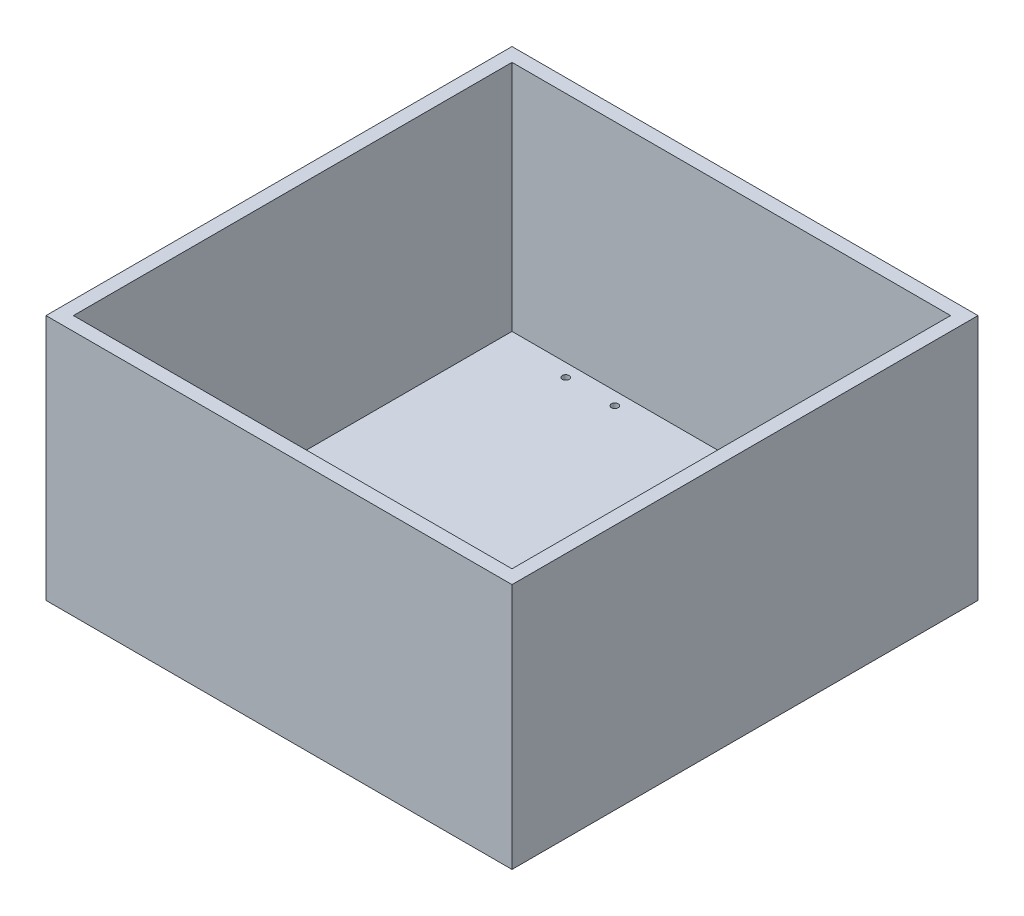
ISO-10303-21;
HEADER;
FILE_DESCRIPTION(('STEP AP214'),'2;1');
FILE_NAME('part.step','',(''),(''),'','','');
FILE_SCHEMA(('AUTOMOTIVE_DESIGN { 1 0 10303 214 1 1 1 1 }'));
ENDSEC;
DATA;
#1=APPLICATION_CONTEXT('core data for automotive mechanical design processes');
#2=APPLICATION_PROTOCOL_DEFINITION('international standard','automotive_design',2000,#1);
#3=PRODUCT_CONTEXT('',#1,'mechanical');
#4=PRODUCT('Part','Part','',(#3));
#5=PRODUCT_RELATED_PRODUCT_CATEGORY('part','',(#4));
#6=PRODUCT_DEFINITION_FORMATION('','',#4);
#7=PRODUCT_DEFINITION_CONTEXT('part definition',#1,'design');
#8=PRODUCT_DEFINITION('design','',#6,#7);
#9=PRODUCT_DEFINITION_SHAPE('','',#8);
#10=(LENGTH_UNIT() NAMED_UNIT(*) SI_UNIT(.MILLI.,.METRE.));
#11=(NAMED_UNIT(*) PLANE_ANGLE_UNIT() SI_UNIT($,.RADIAN.));
#12=(NAMED_UNIT(*) SI_UNIT($,.STERADIAN.) SOLID_ANGLE_UNIT());
#13=UNCERTAINTY_MEASURE_WITH_UNIT(LENGTH_MEASURE(1.E-05),#10,'distance_accuracy_value','');
#14=(GEOMETRIC_REPRESENTATION_CONTEXT(3) GLOBAL_UNCERTAINTY_ASSIGNED_CONTEXT((#13)) GLOBAL_UNIT_ASSIGNED_CONTEXT((#10,
#11,#12)) REPRESENTATION_CONTEXT('',''));
#15=CARTESIAN_POINT('',(0.,0.,0.));
#16=DIRECTION('',(0.,0.,1.));
#17=DIRECTION('',(1.,0.,0.));
#18=AXIS2_PLACEMENT_3D('',#15,#16,#17);
#19=CARTESIAN_POINT('',(0.,0.,0.));
#20=DIRECTION('',(0.,-1.,0.));
#21=DIRECTION('',(0.,0.,-1.));
#22=AXIS2_PLACEMENT_3D('',#19,#20,#21);
#23=PLANE('',#22);
#24=CARTESIAN_POINT('',(37.2745,0.,-203.5175));
#25=DIRECTION('',(0.,-1.,0.));
#26=DIRECTION('',(0.,0.,-1.));
#27=AXIS2_PLACEMENT_3D('',#24,#25,#26);
#28=CIRCLE('',#27,1.5875);
#29=CARTESIAN_POINT('',(37.2745,0.,-205.105));
#30=VERTEX_POINT('',#29);
#31=EDGE_CURVE('E137',#30,#30,#28,.T.);
#32=ORIENTED_EDGE('',*,*,#31,.F.);
#33=EDGE_LOOP('',(#32));
#34=FACE_BOUND('',#33,.T.);
#35=CARTESIAN_POINT('',(37.2745,0.,-91.6305));
#36=DIRECTION('',(0.,-1.,0.));
#37=DIRECTION('',(0.,0.,-1.));
#38=AXIS2_PLACEMENT_3D('',#35,#36,#37);
#39=CIRCLE('',#38,1.5875);
#40=CARTESIAN_POINT('',(37.2745,0.,-93.218));
#41=VERTEX_POINT('',#40);
#42=EDGE_CURVE('E338',#41,#41,#39,.F.);
#43=ORIENTED_EDGE('',*,*,#42,.T.);
#44=EDGE_LOOP('',(#43));
#45=FACE_BOUND('',#44,.T.);
#46=CARTESIAN_POINT('',(60.0075,0.,-203.5175));
#47=DIRECTION('',(0.,-1.,0.));
#48=DIRECTION('',(0.,0.,-1.));
#49=AXIS2_PLACEMENT_3D('',#46,#47,#48);
#50=CIRCLE('',#49,1.5875);
#51=CARTESIAN_POINT('',(60.0075,0.,-205.105));
#52=VERTEX_POINT('',#51);
#53=EDGE_CURVE('E329',#52,#52,#50,.T.);
#54=ORIENTED_EDGE('',*,*,#53,.F.);
#55=EDGE_LOOP('',(#54));
#56=FACE_BOUND('',#55,.T.);
#57=DIRECTION('',(1.,0.,0.));
#58=VECTOR('',#57,1.);
#59=CARTESIAN_POINT('',(0.,0.,0.));
#60=LINE('',#59,#58);
#61=CARTESIAN_POINT('',(0.,0.,0.));
#62=VERTEX_POINT('',#61);
#63=CARTESIAN_POINT('',(215.9,0.,0.));
#64=VERTEX_POINT('',#63);
#65=EDGE_CURVE('E149',#62,#64,#60,.T.);
#66=ORIENTED_EDGE('',*,*,#65,.F.);
#67=DIRECTION('',(0.,0.,1.));
#68=VECTOR('',#67,1.);
#69=CARTESIAN_POINT('',(0.,0.,-215.9));
#70=LINE('',#69,#68);
#71=CARTESIAN_POINT('',(0.,0.,-215.9));
#72=VERTEX_POINT('',#71);
#73=EDGE_CURVE('E81',#72,#62,#70,.T.);
#74=ORIENTED_EDGE('',*,*,#73,.F.);
#75=DIRECTION('',(1.,0.,0.));
#76=VECTOR('',#75,1.);
#77=CARTESIAN_POINT('',(0.,0.,-215.9));
#78=LINE('',#77,#76);
#79=CARTESIAN_POINT('',(215.9,0.,-215.9));
#80=VERTEX_POINT('',#79);
#81=EDGE_CURVE('E167',#72,#80,#78,.T.);
#82=ORIENTED_EDGE('',*,*,#81,.T.);
#83=DIRECTION('',(0.,0.,1.));
#84=VECTOR('',#83,1.);
#85=CARTESIAN_POINT('',(215.9,0.,-215.9));
#86=LINE('',#85,#84);
#87=EDGE_CURVE('E164',#80,#64,#86,.T.);
#88=ORIENTED_EDGE('',*,*,#87,.T.);
#89=EDGE_LOOP('',(#66,#74,#82,#88));
#90=FACE_BOUND('',#89,.T.);
#91=CARTESIAN_POINT('',(59.8805,0.,-91.6305));
#92=DIRECTION('',(0.,-1.,0.));
#93=DIRECTION('',(0.,0.,-1.));
#94=AXIS2_PLACEMENT_3D('',#91,#92,#93);
#95=CIRCLE('',#94,1.5875);
#96=CARTESIAN_POINT('',(59.8805,0.,-93.218));
#97=VERTEX_POINT('',#96);
#98=EDGE_CURVE('E340',#97,#97,#95,.F.);
#99=ORIENTED_EDGE('',*,*,#98,.T.);
#100=EDGE_LOOP('',(#99));
#101=FACE_BOUND('',#100,.T.);
#102=ADVANCED_FACE('F37',(#34,#45,#56,#90,#101),#23,.T.);
#103=CARTESIAN_POINT('',(0.,6.35000000000001,0.));
#104=DIRECTION('',(0.,1.,0.));
#105=DIRECTION('',(0.,0.,1.));
#106=AXIS2_PLACEMENT_3D('',#103,#104,#105);
#107=PLANE('',#106);
#108=CARTESIAN_POINT('',(37.2745,6.35000000000001,-203.5175));
#109=DIRECTION('',(0.,1.,0.));
#110=DIRECTION('',(0.,0.,1.));
#111=AXIS2_PLACEMENT_3D('',#108,#109,#110);
#112=CIRCLE('',#111,1.5875);
#113=CARTESIAN_POINT('',(37.2745,6.35000000000001,-201.93));
#114=VERTEX_POINT('',#113);
#115=EDGE_CURVE('E324',#114,#114,#112,.T.);
#116=ORIENTED_EDGE('',*,*,#115,.F.);
#117=EDGE_LOOP('',(#116));
#118=FACE_BOUND('',#117,.T.);
#119=CARTESIAN_POINT('',(37.2745,6.35000000000001,-91.6305));
#120=DIRECTION('',(0.,-1.,0.));
#121=DIRECTION('',(0.,0.,-1.));
#122=AXIS2_PLACEMENT_3D('',#119,#120,#121);
#123=CIRCLE('',#122,1.5875);
#124=CARTESIAN_POINT('',(37.2745,6.35000000000001,-93.218));
#125=VERTEX_POINT('',#124);
#126=EDGE_CURVE('E332',#125,#125,#123,.T.);
#127=ORIENTED_EDGE('',*,*,#126,.T.);
#128=EDGE_LOOP('',(#127));
#129=FACE_BOUND('',#128,.T.);
#130=CARTESIAN_POINT('',(60.0075,6.35000000000001,-203.5175));
#131=DIRECTION('',(0.,1.,0.));
#132=DIRECTION('',(0.,0.,1.));
#133=AXIS2_PLACEMENT_3D('',#130,#131,#132);
#134=CIRCLE('',#133,1.5875);
#135=CARTESIAN_POINT('',(60.0075,6.35000000000001,-201.93));
#136=VERTEX_POINT('',#135);
#137=EDGE_CURVE('E325',#136,#136,#134,.T.);
#138=ORIENTED_EDGE('',*,*,#137,.F.);
#139=EDGE_LOOP('',(#138));
#140=FACE_BOUND('',#139,.T.);
#141=DIRECTION('',(0.,0.,1.));
#142=VECTOR('',#141,1.);
#143=CARTESIAN_POINT('',(6.34999999999996,6.35000000000001,-209.55));
#144=LINE('',#143,#142);
#145=CARTESIAN_POINT('',(6.34999999999996,6.35000000000001,-209.55));
#146=VERTEX_POINT('',#145);
#147=CARTESIAN_POINT('',(6.34999999999998,6.35000000000001,-6.34999999999999));
#148=VERTEX_POINT('',#147);
#149=EDGE_CURVE('E112',#146,#148,#144,.T.);
#150=ORIENTED_EDGE('',*,*,#149,.T.);
#151=DIRECTION('',(1.,0.,0.));
#152=VECTOR('',#151,1.);
#153=CARTESIAN_POINT('',(6.34999999999998,6.35000000000001,-6.34999999999999));
#154=LINE('',#153,#152);
#155=CARTESIAN_POINT('',(209.55,6.35000000000001,-6.34999999999999));
#156=VERTEX_POINT('',#155);
#157=EDGE_CURVE('E121',#148,#156,#154,.T.);
#158=ORIENTED_EDGE('',*,*,#157,.T.);
#159=DIRECTION('',(0.,0.,-1.));
#160=VECTOR('',#159,1.);
#161=CARTESIAN_POINT('',(209.55,6.35000000000001,-209.55));
#162=LINE('',#161,#160);
#163=CARTESIAN_POINT('',(209.55,6.35000000000001,-209.55));
#164=VERTEX_POINT('',#163);
#165=EDGE_CURVE('E126',#156,#164,#162,.T.);
#166=ORIENTED_EDGE('',*,*,#165,.T.);
#167=DIRECTION('',(-1.,0.,0.));
#168=VECTOR('',#167,1.);
#169=CARTESIAN_POINT('',(6.34999999999996,6.35000000000001,-209.55));
#170=LINE('',#169,#168);
#171=EDGE_CURVE('E118',#164,#146,#170,.T.);
#172=ORIENTED_EDGE('',*,*,#171,.T.);
#173=EDGE_LOOP('',(#150,#158,#166,#172));
#174=FACE_BOUND('',#173,.T.);
#175=CARTESIAN_POINT('',(59.8805,6.35000000000001,-91.6305));
#176=DIRECTION('',(0.,-1.,0.));
#177=DIRECTION('',(0.,0.,-1.));
#178=AXIS2_PLACEMENT_3D('',#175,#176,#177);
#179=CIRCLE('',#178,1.5875);
#180=CARTESIAN_POINT('',(59.8805,6.35000000000001,-93.218));
#181=VERTEX_POINT('',#180);
#182=EDGE_CURVE('E326',#181,#181,#179,.T.);
#183=ORIENTED_EDGE('',*,*,#182,.T.);
#184=EDGE_LOOP('',(#183));
#185=FACE_BOUND('',#184,.T.);
#186=ADVANCED_FACE('F128',(#118,#129,#140,#174,#185),#107,.T.);
#187=CARTESIAN_POINT('',(0.,114.3,0.));
#188=DIRECTION('',(0.,0.,-1.));
#189=DIRECTION('',(-1.,0.,0.));
#190=AXIS2_PLACEMENT_3D('',#187,#188,#189);
#191=PLANE('',#190);
#192=ORIENTED_EDGE('',*,*,#65,.T.);
#193=DIRECTION('',(0.,-1.,0.));
#194=VECTOR('',#193,1.);
#195=CARTESIAN_POINT('',(215.9,114.3,0.));
#196=LINE('',#195,#194);
#197=CARTESIAN_POINT('',(215.9,114.3,0.));
#198=VERTEX_POINT('',#197);
#199=EDGE_CURVE('E11',#198,#64,#196,.T.);
#200=ORIENTED_EDGE('',*,*,#199,.F.);
#201=DIRECTION('',(1.,0.,0.));
#202=VECTOR('',#201,1.);
#203=CARTESIAN_POINT('',(0.,114.3,0.));
#204=LINE('',#203,#202);
#205=CARTESIAN_POINT('',(0.,114.3,0.));
#206=VERTEX_POINT('',#205);
#207=EDGE_CURVE('E86',#206,#198,#204,.T.);
#208=ORIENTED_EDGE('',*,*,#207,.F.);
#209=DIRECTION('',(0.,-1.,0.));
#210=VECTOR('',#209,1.);
#211=CARTESIAN_POINT('',(0.,114.3,0.));
#212=LINE('',#211,#210);
#213=EDGE_CURVE('E161',#206,#62,#212,.T.);
#214=ORIENTED_EDGE('',*,*,#213,.T.);
#215=EDGE_LOOP('',(#192,#200,#208,#214));
#216=FACE_BOUND('',#215,.T.);
#217=ADVANCED_FACE('F39',(#216),#191,.F.);
#218=CARTESIAN_POINT('',(215.9,114.3,-215.9));
#219=DIRECTION('',(1.,0.,0.));
#220=DIRECTION('',(0.,0.,-1.));
#221=AXIS2_PLACEMENT_3D('',#218,#219,#220);
#222=PLANE('',#221);
#223=ORIENTED_EDGE('',*,*,#87,.F.);
#224=DIRECTION('',(0.,-1.,0.));
#225=VECTOR('',#224,1.);
#226=CARTESIAN_POINT('',(215.9,114.3,-215.9));
#227=LINE('',#226,#225);
#228=CARTESIAN_POINT('',(215.9,114.3,-215.9));
#229=VERTEX_POINT('',#228);
#230=EDGE_CURVE('E45',#229,#80,#227,.T.);
#231=ORIENTED_EDGE('',*,*,#230,.F.);
#232=DIRECTION('',(0.,0.,1.));
#233=VECTOR('',#232,1.);
#234=CARTESIAN_POINT('',(215.9,114.3,-215.9));
#235=LINE('',#234,#233);
#236=EDGE_CURVE('E154',#229,#198,#235,.T.);
#237=ORIENTED_EDGE('',*,*,#236,.T.);
#238=ORIENTED_EDGE('',*,*,#199,.T.);
#239=EDGE_LOOP('',(#223,#231,#237,#238));
#240=FACE_BOUND('',#239,.T.);
#241=ADVANCED_FACE('F178',(#240),#222,.T.);
#242=CARTESIAN_POINT('',(0.,114.3,-215.9));
#243=DIRECTION('',(0.,0.,-1.));
#244=DIRECTION('',(-1.,0.,0.));
#245=AXIS2_PLACEMENT_3D('',#242,#243,#244);
#246=PLANE('',#245);
#247=ORIENTED_EDGE('',*,*,#81,.F.);
#248=DIRECTION('',(0.,-1.,0.));
#249=VECTOR('',#248,1.);
#250=CARTESIAN_POINT('',(0.,114.3,-215.9));
#251=LINE('',#250,#249);
#252=CARTESIAN_POINT('',(0.,114.3,-215.9));
#253=VERTEX_POINT('',#252);
#254=EDGE_CURVE('E172',#253,#72,#251,.T.);
#255=ORIENTED_EDGE('',*,*,#254,.F.);
#256=DIRECTION('',(1.,0.,0.));
#257=VECTOR('',#256,1.);
#258=CARTESIAN_POINT('',(0.,114.3,-215.9));
#259=LINE('',#258,#257);
#260=EDGE_CURVE('E157',#253,#229,#259,.T.);
#261=ORIENTED_EDGE('',*,*,#260,.T.);
#262=ORIENTED_EDGE('',*,*,#230,.T.);
#263=EDGE_LOOP('',(#247,#255,#261,#262));
#264=FACE_BOUND('',#263,.T.);
#265=ADVANCED_FACE('F176',(#264),#246,.T.);
#266=CARTESIAN_POINT('',(0.,114.3,-215.9));
#267=DIRECTION('',(1.,0.,0.));
#268=DIRECTION('',(0.,0.,-1.));
#269=AXIS2_PLACEMENT_3D('',#266,#267,#268);
#270=PLANE('',#269);
#271=ORIENTED_EDGE('',*,*,#73,.T.);
#272=ORIENTED_EDGE('',*,*,#213,.F.);
#273=DIRECTION('',(0.,0.,1.));
#274=VECTOR('',#273,1.);
#275=CARTESIAN_POINT('',(0.,114.3,-215.9));
#276=LINE('',#275,#274);
#277=EDGE_CURVE('E61',#253,#206,#276,.T.);
#278=ORIENTED_EDGE('',*,*,#277,.F.);
#279=ORIENTED_EDGE('',*,*,#254,.T.);
#280=EDGE_LOOP('',(#271,#272,#278,#279));
#281=FACE_BOUND('',#280,.T.);
#282=ADVANCED_FACE('F183',(#281),#270,.F.);
#283=CARTESIAN_POINT('',(0.,114.3,0.));
#284=DIRECTION('',(0.,-1.,0.));
#285=DIRECTION('',(0.,0.,-1.));
#286=AXIS2_PLACEMENT_3D('',#283,#284,#285);
#287=PLANE('',#286);
#288=DIRECTION('',(1.,0.,0.));
#289=VECTOR('',#288,1.);
#290=CARTESIAN_POINT('',(6.34999999999998,114.3,-6.34999999999999));
#291=LINE('',#290,#289);
#292=CARTESIAN_POINT('',(6.34999999999998,114.3,-6.34999999999999));
#293=VERTEX_POINT('',#292);
#294=CARTESIAN_POINT('',(209.55,114.3,-6.34999999999999));
#295=VERTEX_POINT('',#294);
#296=EDGE_CURVE('E143',#293,#295,#291,.T.);
#297=ORIENTED_EDGE('',*,*,#296,.F.);
#298=DIRECTION('',(0.,0.,1.));
#299=VECTOR('',#298,1.);
#300=CARTESIAN_POINT('',(6.34999999999996,114.3,-209.55));
#301=LINE('',#300,#299);
#302=CARTESIAN_POINT('',(6.34999999999996,114.3,-209.55));
#303=VERTEX_POINT('',#302);
#304=EDGE_CURVE('E52',#303,#293,#301,.T.);
#305=ORIENTED_EDGE('',*,*,#304,.F.);
#306=DIRECTION('',(-1.,0.,0.));
#307=VECTOR('',#306,1.);
#308=CARTESIAN_POINT('',(6.34999999999996,114.3,-209.55));
#309=LINE('',#308,#307);
#310=CARTESIAN_POINT('',(209.55,114.3,-209.55));
#311=VERTEX_POINT('',#310);
#312=EDGE_CURVE('E131',#311,#303,#309,.T.);
#313=ORIENTED_EDGE('',*,*,#312,.F.);
#314=DIRECTION('',(0.,0.,-1.));
#315=VECTOR('',#314,1.);
#316=CARTESIAN_POINT('',(209.55,114.3,-209.55));
#317=LINE('',#316,#315);
#318=EDGE_CURVE('E134',#295,#311,#317,.T.);
#319=ORIENTED_EDGE('',*,*,#318,.F.);
#320=EDGE_LOOP('',(#297,#305,#313,#319));
#321=FACE_BOUND('',#320,.T.);
#322=ORIENTED_EDGE('',*,*,#207,.T.);
#323=ORIENTED_EDGE('',*,*,#236,.F.);
#324=ORIENTED_EDGE('',*,*,#260,.F.);
#325=ORIENTED_EDGE('',*,*,#277,.T.);
#326=EDGE_LOOP('',(#322,#323,#324,#325));
#327=FACE_BOUND('',#326,.T.);
#328=ADVANCED_FACE('F184',(#321,#327),#287,.F.);
#329=CARTESIAN_POINT('',(6.34999999999996,6.35000000000001,-209.55));
#330=DIRECTION('',(-1.,0.,0.));
#331=DIRECTION('',(0.,0.,1.));
#332=AXIS2_PLACEMENT_3D('',#329,#330,#331);
#333=PLANE('',#332);
#334=ORIENTED_EDGE('',*,*,#304,.T.);
#335=DIRECTION('',(0.,1.,0.));
#336=VECTOR('',#335,1.);
#337=CARTESIAN_POINT('',(6.34999999999998,6.35000000000001,-6.34999999999999));
#338=LINE('',#337,#336);
#339=EDGE_CURVE('E108',#148,#293,#338,.T.);
#340=ORIENTED_EDGE('',*,*,#339,.F.);
#341=ORIENTED_EDGE('',*,*,#149,.F.);
#342=DIRECTION('',(0.,1.,0.));
#343=VECTOR('',#342,1.);
#344=CARTESIAN_POINT('',(6.34999999999996,6.35000000000001,-209.55));
#345=LINE('',#344,#343);
#346=EDGE_CURVE('E147',#146,#303,#345,.T.);
#347=ORIENTED_EDGE('',*,*,#346,.T.);
#348=EDGE_LOOP('',(#334,#340,#341,#347));
#349=FACE_BOUND('',#348,.T.);
#350=ADVANCED_FACE('F110',(#349),#333,.F.);
#351=CARTESIAN_POINT('',(6.34999999999996,6.35000000000001,-209.55));
#352=DIRECTION('',(0.,0.,-1.));
#353=DIRECTION('',(-1.,0.,0.));
#354=AXIS2_PLACEMENT_3D('',#351,#352,#353);
#355=PLANE('',#354);
#356=ORIENTED_EDGE('',*,*,#312,.T.);
#357=ORIENTED_EDGE('',*,*,#346,.F.);
#358=ORIENTED_EDGE('',*,*,#171,.F.);
#359=DIRECTION('',(0.,1.,0.));
#360=VECTOR('',#359,1.);
#361=CARTESIAN_POINT('',(209.55,6.35000000000001,-209.55));
#362=LINE('',#361,#360);
#363=EDGE_CURVE('E150',#164,#311,#362,.T.);
#364=ORIENTED_EDGE('',*,*,#363,.T.);
#365=EDGE_LOOP('',(#356,#357,#358,#364));
#366=FACE_BOUND('',#365,.T.);
#367=ADVANCED_FACE('F192',(#366),#355,.F.);
#368=CARTESIAN_POINT('',(209.55,6.35000000000001,-209.55));
#369=DIRECTION('',(1.,0.,0.));
#370=DIRECTION('',(0.,0.,-1.));
#371=AXIS2_PLACEMENT_3D('',#368,#369,#370);
#372=PLANE('',#371);
#373=ORIENTED_EDGE('',*,*,#318,.T.);
#374=ORIENTED_EDGE('',*,*,#363,.F.);
#375=ORIENTED_EDGE('',*,*,#165,.F.);
#376=DIRECTION('',(0.,1.,0.));
#377=VECTOR('',#376,1.);
#378=CARTESIAN_POINT('',(209.55,6.35000000000001,-6.34999999999999));
#379=LINE('',#378,#377);
#380=EDGE_CURVE('E117',#156,#295,#379,.T.);
#381=ORIENTED_EDGE('',*,*,#380,.T.);
#382=EDGE_LOOP('',(#373,#374,#375,#381));
#383=FACE_BOUND('',#382,.T.);
#384=ADVANCED_FACE('F271',(#383),#372,.F.);
#385=CARTESIAN_POINT('',(6.34999999999998,6.35000000000001,-6.34999999999999));
#386=DIRECTION('',(0.,0.,1.));
#387=DIRECTION('',(1.,0.,0.));
#388=AXIS2_PLACEMENT_3D('',#385,#386,#387);
#389=PLANE('',#388);
#390=ORIENTED_EDGE('',*,*,#296,.T.);
#391=ORIENTED_EDGE('',*,*,#380,.F.);
#392=ORIENTED_EDGE('',*,*,#157,.F.);
#393=ORIENTED_EDGE('',*,*,#339,.T.);
#394=EDGE_LOOP('',(#390,#391,#392,#393));
#395=FACE_BOUND('',#394,.T.);
#396=ADVANCED_FACE('F122',(#395),#389,.F.);
#397=CARTESIAN_POINT('',(60.0075,-101.6,-203.5175));
#398=DIRECTION('',(0.,1.,0.));
#399=DIRECTION('',(0.,0.,1.));
#400=AXIS2_PLACEMENT_3D('',#397,#398,#399);
#401=CYLINDRICAL_SURFACE('',#400,1.5875);
#402=ORIENTED_EDGE('',*,*,#53,.T.);
#403=EDGE_LOOP('',(#402));
#404=FACE_BOUND('',#403,.T.);
#405=ORIENTED_EDGE('',*,*,#137,.T.);
#406=EDGE_LOOP('',(#405));
#407=FACE_BOUND('',#406,.T.);
#408=ADVANCED_FACE('F226',(#404,#407),#401,.F.);
#409=CARTESIAN_POINT('',(37.2745,-101.6,-91.6305));
#410=DIRECTION('',(0.,1.,0.));
#411=DIRECTION('',(0.,0.,1.));
#412=AXIS2_PLACEMENT_3D('',#409,#410,#411);
#413=CYLINDRICAL_SURFACE('',#412,1.5875);
#414=ORIENTED_EDGE('',*,*,#42,.F.);
#415=EDGE_LOOP('',(#414));
#416=FACE_BOUND('',#415,.T.);
#417=ORIENTED_EDGE('',*,*,#126,.F.);
#418=EDGE_LOOP('',(#417));
#419=FACE_BOUND('',#418,.T.);
#420=ADVANCED_FACE('F231',(#416,#419),#413,.F.);
#421=CARTESIAN_POINT('',(59.8805,-101.6,-91.6305));
#422=DIRECTION('',(0.,1.,0.));
#423=DIRECTION('',(0.,0.,1.));
#424=AXIS2_PLACEMENT_3D('',#421,#422,#423);
#425=CYLINDRICAL_SURFACE('',#424,1.5875);
#426=ORIENTED_EDGE('',*,*,#98,.F.);
#427=EDGE_LOOP('',(#426));
#428=FACE_BOUND('',#427,.T.);
#429=ORIENTED_EDGE('',*,*,#182,.F.);
#430=EDGE_LOOP('',(#429));
#431=FACE_BOUND('',#430,.T.);
#432=ADVANCED_FACE('F242',(#428,#431),#425,.F.);
#433=CARTESIAN_POINT('',(37.2745,-101.6,-203.5175));
#434=DIRECTION('',(0.,1.,0.));
#435=DIRECTION('',(0.,0.,1.));
#436=AXIS2_PLACEMENT_3D('',#433,#434,#435);
#437=CYLINDRICAL_SURFACE('',#436,1.5875);
#438=ORIENTED_EDGE('',*,*,#31,.T.);
#439=EDGE_LOOP('',(#438));
#440=FACE_BOUND('',#439,.T.);
#441=ORIENTED_EDGE('',*,*,#115,.T.);
#442=EDGE_LOOP('',(#441));
#443=FACE_BOUND('',#442,.T.);
#444=ADVANCED_FACE('F252',(#440,#443),#437,.F.);
#445=CLOSED_SHELL('',(#102,#186,#217,#241,#265,#282,#328,#350,#367,#384,#396,#408,#420,#432,#444));
#446=MANIFOLD_SOLID_BREP('B2',#445);
#447=ADVANCED_BREP_SHAPE_REPRESENTATION('',(#18,#446),#14);
#448=SHAPE_DEFINITION_REPRESENTATION(#9,#447);
ENDSEC;
END-ISO-10303-21;
